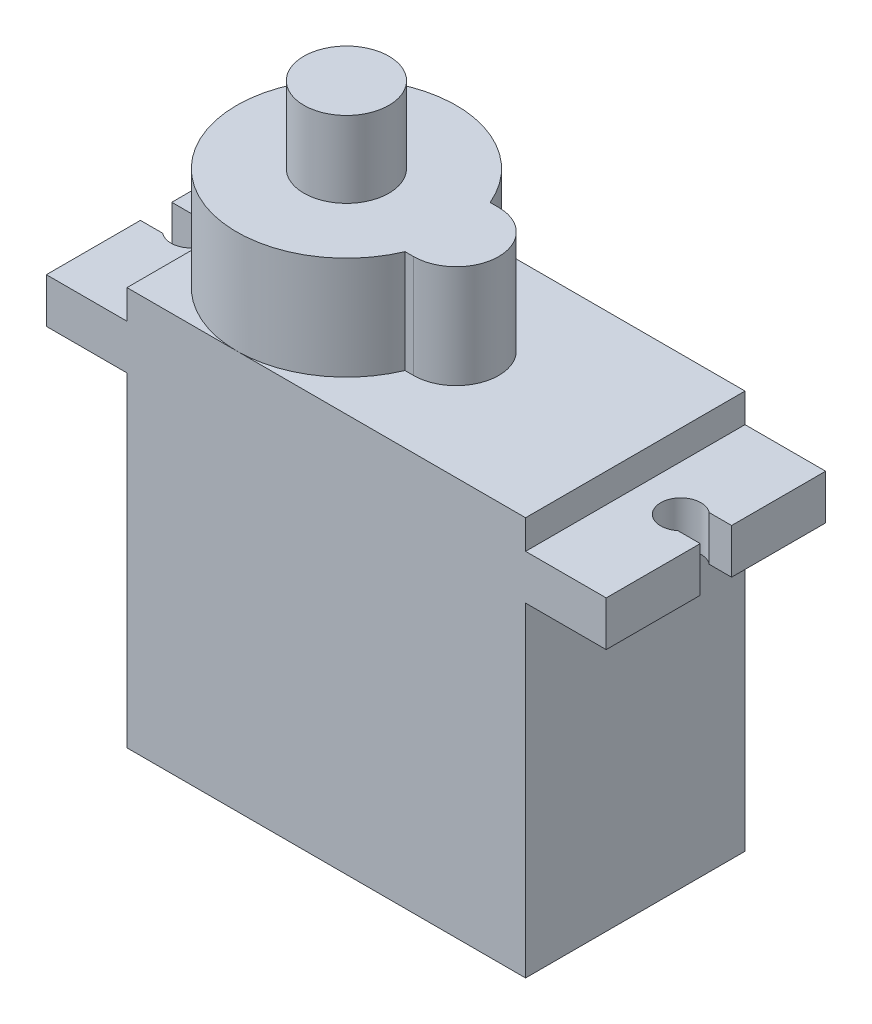
ISO-10303-21;
HEADER;
FILE_DESCRIPTION(('STEP AP214'),'2;1');
FILE_NAME('part.step','',(''),(''),'','','');
FILE_SCHEMA(('AUTOMOTIVE_DESIGN { 1 0 10303 214 1 1 1 1 }'));
ENDSEC;
DATA;
#1=APPLICATION_CONTEXT('core data for automotive mechanical design processes');
#2=APPLICATION_PROTOCOL_DEFINITION('international standard','automotive_design',2000,#1);
#3=PRODUCT_CONTEXT('',#1,'mechanical');
#4=PRODUCT('Part','Part','',(#3));
#5=PRODUCT_RELATED_PRODUCT_CATEGORY('part','',(#4));
#6=PRODUCT_DEFINITION_FORMATION('','',#4);
#7=PRODUCT_DEFINITION_CONTEXT('part definition',#1,'design');
#8=PRODUCT_DEFINITION('design','',#6,#7);
#9=PRODUCT_DEFINITION_SHAPE('','',#8);
#10=(LENGTH_UNIT() NAMED_UNIT(*) SI_UNIT(.MILLI.,.METRE.));
#11=(NAMED_UNIT(*) PLANE_ANGLE_UNIT() SI_UNIT($,.RADIAN.));
#12=(NAMED_UNIT(*) SI_UNIT($,.STERADIAN.) SOLID_ANGLE_UNIT());
#13=UNCERTAINTY_MEASURE_WITH_UNIT(LENGTH_MEASURE(1.E-05),#10,'distance_accuracy_value','');
#14=(GEOMETRIC_REPRESENTATION_CONTEXT(3) GLOBAL_UNCERTAINTY_ASSIGNED_CONTEXT((#13)) GLOBAL_UNIT_ASSIGNED_CONTEXT((#10,
#11,#12)) REPRESENTATION_CONTEXT('',''));
#15=CARTESIAN_POINT('',(0.,0.,0.));
#16=DIRECTION('',(0.,0.,1.));
#17=DIRECTION('',(1.,0.,0.));
#18=AXIS2_PLACEMENT_3D('',#15,#16,#17);
#19=CARTESIAN_POINT('',(0.,22.606,0.));
#20=DIRECTION('',(0.,1.,0.));
#21=DIRECTION('',(0.,0.,1.));
#22=AXIS2_PLACEMENT_3D('',#19,#20,#21);
#23=PLANE('',#22);
#24=DIRECTION('',(-1.,0.,0.));
#25=VECTOR('',#24,1.);
#26=CARTESIAN_POINT('',(0.,22.606,2.413));
#27=LINE('',#26,#25);
#28=CARTESIAN_POINT('',(1.143,22.606,2.413));
#29=VERTEX_POINT('',#28);
#30=CARTESIAN_POINT('',(0.656127613643196,22.606,2.413));
#31=VERTEX_POINT('',#30);
#32=EDGE_CURVE('E232',#29,#31,#27,.T.);
#33=ORIENTED_EDGE('',*,*,#32,.T.);
#34=CARTESIAN_POINT('',(-5.08,22.606,0.));
#35=DIRECTION('',(0.,1.,0.));
#36=DIRECTION('',(0.,0.,1.));
#37=AXIS2_PLACEMENT_3D('',#34,#35,#36);
#38=CIRCLE('',#37,6.223);
#39=CARTESIAN_POINT('',(-5.08,22.606,6.223));
#40=VERTEX_POINT('',#39);
#41=EDGE_CURVE('E51',#31,#40,#38,.F.);
#42=ORIENTED_EDGE('',*,*,#41,.T.);
#43=DIRECTION('',(1.,0.,0.));
#44=VECTOR('',#43,1.);
#45=CARTESIAN_POINT('',(11.303,22.606,6.223));
#46=LINE('',#45,#44);
#47=CARTESIAN_POINT('',(11.303,22.606,6.223));
#48=VERTEX_POINT('',#47);
#49=EDGE_CURVE('E248',#40,#48,#46,.T.);
#50=ORIENTED_EDGE('',*,*,#49,.T.);
#51=DIRECTION('',(0.,0.,-1.));
#52=VECTOR('',#51,1.);
#53=CARTESIAN_POINT('',(11.303,22.606,6.223));
#54=LINE('',#53,#52);
#55=CARTESIAN_POINT('',(11.303,22.606,-6.223));
#56=VERTEX_POINT('',#55);
#57=EDGE_CURVE('E253',#48,#56,#54,.T.);
#58=ORIENTED_EDGE('',*,*,#57,.T.);
#59=DIRECTION('',(-1.,0.,0.));
#60=VECTOR('',#59,1.);
#61=CARTESIAN_POINT('',(11.303,22.606,-6.223));
#62=LINE('',#61,#60);
#63=CARTESIAN_POINT('',(-5.08,22.606,-6.223));
#64=VERTEX_POINT('',#63);
#65=EDGE_CURVE('E256',#56,#64,#62,.T.);
#66=ORIENTED_EDGE('',*,*,#65,.T.);
#67=CARTESIAN_POINT('',(0.656127613643197,22.606,-2.413));
#68=VERTEX_POINT('',#67);
#69=EDGE_CURVE('E234',#64,#68,#38,.F.);
#70=ORIENTED_EDGE('',*,*,#69,.T.);
#71=DIRECTION('',(-1.,0.,0.));
#72=VECTOR('',#71,1.);
#73=CARTESIAN_POINT('',(0.,22.606,-2.413));
#74=LINE('',#73,#72);
#75=CARTESIAN_POINT('',(1.143,22.606,-2.413));
#76=VERTEX_POINT('',#75);
#77=EDGE_CURVE('E221',#76,#68,#74,.T.);
#78=ORIENTED_EDGE('',*,*,#77,.F.);
#79=CARTESIAN_POINT('',(1.143,22.606,0.));
#80=DIRECTION('',(0.,1.,0.));
#81=DIRECTION('',(0.,0.,1.));
#82=AXIS2_PLACEMENT_3D('',#79,#80,#81);
#83=CIRCLE('',#82,2.413);
#84=EDGE_CURVE('E236',#29,#76,#83,.T.);
#85=ORIENTED_EDGE('',*,*,#84,.F.);
#86=EDGE_LOOP('',(#33,#42,#50,#58,#66,#70,#78,#85));
#87=FACE_BOUND('',#86,.T.);
#88=ADVANCED_FACE('F34',(#87),#23,.T.);
#89=CARTESIAN_POINT('',(-11.303,22.606,6.223));
#90=VERTEX_POINT('',#89);
#91=EDGE_CURVE('E250',#90,#40,#46,.T.);
#92=ORIENTED_EDGE('',*,*,#91,.T.);
#93=CARTESIAN_POINT('',(-11.303,22.606,0.));
#94=VERTEX_POINT('',#93);
#95=EDGE_CURVE('E43',#40,#94,#38,.F.);
#96=ORIENTED_EDGE('',*,*,#95,.T.);
#97=DIRECTION('',(0.,0.,1.));
#98=VECTOR('',#97,1.);
#99=CARTESIAN_POINT('',(-11.303,22.606,6.223));
#100=LINE('',#99,#98);
#101=EDGE_CURVE('E249',#94,#90,#100,.T.);
#102=ORIENTED_EDGE('',*,*,#101,.T.);
#103=EDGE_LOOP('',(#92,#96,#102));
#104=FACE_BOUND('',#103,.T.);
#105=ADVANCED_FACE('F404',(#104),#23,.T.);
#106=CARTESIAN_POINT('',(-11.303,22.606,-6.223));
#107=VERTEX_POINT('',#106);
#108=EDGE_CURVE('E245',#107,#94,#100,.T.);
#109=ORIENTED_EDGE('',*,*,#108,.T.);
#110=EDGE_CURVE('E395',#94,#64,#38,.F.);
#111=ORIENTED_EDGE('',*,*,#110,.T.);
#112=EDGE_CURVE('E255',#64,#107,#62,.T.);
#113=ORIENTED_EDGE('',*,*,#112,.T.);
#114=EDGE_LOOP('',(#109,#111,#113));
#115=FACE_BOUND('',#114,.T.);
#116=ADVANCED_FACE('F410',(#115),#23,.T.);
#117=CARTESIAN_POINT('',(-13.8865795103145,20.955,0.));
#118=DIRECTION('',(0.,-1.,0.));
#119=DIRECTION('',(0.,0.,-1.));
#120=AXIS2_PLACEMENT_3D('',#117,#118,#119);
#121=PLANE('',#120);
#122=DIRECTION('',(0.,0.,1.));
#123=VECTOR('',#122,1.);
#124=CARTESIAN_POINT('',(-11.303,20.955,6.223));
#125=LINE('',#124,#123);
#126=CARTESIAN_POINT('',(-11.303,20.955,-6.223));
#127=VERTEX_POINT('',#126);
#128=CARTESIAN_POINT('',(-11.303,20.955,6.223));
#129=VERTEX_POINT('',#128);
#130=EDGE_CURVE('E59',#127,#129,#125,.T.);
#131=ORIENTED_EDGE('',*,*,#130,.F.);
#132=DIRECTION('',(-1.,0.,0.));
#133=VECTOR('',#132,1.);
#134=CARTESIAN_POINT('',(15.875,20.955,-6.223));
#135=LINE('',#134,#133);
#136=CARTESIAN_POINT('',(-15.875,20.955,-6.223));
#137=VERTEX_POINT('',#136);
#138=EDGE_CURVE('E301',#127,#137,#135,.T.);
#139=ORIENTED_EDGE('',*,*,#138,.T.);
#140=DIRECTION('',(0.,0.,1.));
#141=VECTOR('',#140,1.);
#142=CARTESIAN_POINT('',(-15.875,20.955,-6.223));
#143=LINE('',#142,#141);
#144=CARTESIAN_POINT('',(-15.875,20.955,-0.889));
#145=VERTEX_POINT('',#144);
#146=EDGE_CURVE('E276',#137,#145,#143,.T.);
#147=ORIENTED_EDGE('',*,*,#146,.T.);
#148=DIRECTION('',(1.,0.,0.));
#149=VECTOR('',#148,1.);
#150=CARTESIAN_POINT('',(-15.875,20.955,-0.889));
#151=LINE('',#150,#149);
#152=CARTESIAN_POINT('',(-14.605,20.955,-0.889));
#153=VERTEX_POINT('',#152);
#154=EDGE_CURVE('E279',#145,#153,#151,.T.);
#155=ORIENTED_EDGE('',*,*,#154,.T.);
#156=CARTESIAN_POINT('',(-13.8865795103145,20.955,0.));
#157=DIRECTION('',(0.,-1.,0.));
#158=DIRECTION('',(0.,0.,-1.));
#159=AXIS2_PLACEMENT_3D('',#156,#157,#158);
#160=CIRCLE('',#159,1.143);
#161=CARTESIAN_POINT('',(-14.605,20.955,0.889));
#162=VERTEX_POINT('',#161);
#163=EDGE_CURVE('E282',#153,#162,#160,.T.);
#164=ORIENTED_EDGE('',*,*,#163,.T.);
#165=DIRECTION('',(-1.,0.,0.));
#166=VECTOR('',#165,1.);
#167=CARTESIAN_POINT('',(-15.875,20.955,0.889));
#168=LINE('',#167,#166);
#169=CARTESIAN_POINT('',(-15.875,20.955,0.889));
#170=VERTEX_POINT('',#169);
#171=EDGE_CURVE('E284',#162,#170,#168,.T.);
#172=ORIENTED_EDGE('',*,*,#171,.T.);
#173=DIRECTION('',(0.,0.,1.));
#174=VECTOR('',#173,1.);
#175=CARTESIAN_POINT('',(-15.875,20.955,6.223));
#176=LINE('',#175,#174);
#177=CARTESIAN_POINT('',(-15.875,20.955,6.223));
#178=VERTEX_POINT('',#177);
#179=EDGE_CURVE('E286',#170,#178,#176,.T.);
#180=ORIENTED_EDGE('',*,*,#179,.T.);
#181=DIRECTION('',(1.,0.,0.));
#182=VECTOR('',#181,1.);
#183=CARTESIAN_POINT('',(15.875,20.955,6.223));
#184=LINE('',#183,#182);
#185=EDGE_CURVE('E289',#178,#129,#184,.T.);
#186=ORIENTED_EDGE('',*,*,#185,.T.);
#187=EDGE_LOOP('',(#131,#139,#147,#155,#164,#172,#180,#186));
#188=FACE_BOUND('',#187,.T.);
#189=ADVANCED_FACE('F417',(#188),#121,.F.);
#190=DIRECTION('',(0.,0.,-1.));
#191=VECTOR('',#190,1.);
#192=CARTESIAN_POINT('',(11.303,20.955,6.223));
#193=LINE('',#192,#191);
#194=CARTESIAN_POINT('',(11.303,20.955,6.223));
#195=VERTEX_POINT('',#194);
#196=CARTESIAN_POINT('',(11.303,20.955,-6.223));
#197=VERTEX_POINT('',#196);
#198=EDGE_CURVE('E261',#195,#197,#193,.T.);
#199=ORIENTED_EDGE('',*,*,#198,.F.);
#200=CARTESIAN_POINT('',(15.875,20.955,6.223));
#201=VERTEX_POINT('',#200);
#202=EDGE_CURVE('E288',#195,#201,#184,.T.);
#203=ORIENTED_EDGE('',*,*,#202,.T.);
#204=DIRECTION('',(0.,0.,-1.));
#205=VECTOR('',#204,1.);
#206=CARTESIAN_POINT('',(15.875,20.955,6.223));
#207=LINE('',#206,#205);
#208=CARTESIAN_POINT('',(15.875,20.955,0.889000000000035));
#209=VERTEX_POINT('',#208);
#210=EDGE_CURVE('E291',#201,#209,#207,.T.);
#211=ORIENTED_EDGE('',*,*,#210,.T.);
#212=DIRECTION('',(-1.,0.,0.));
#213=VECTOR('',#212,1.);
#214=CARTESIAN_POINT('',(15.875,20.955,0.889000000000035));
#215=LINE('',#214,#213);
#216=CARTESIAN_POINT('',(14.605,20.955,0.889000000000034));
#217=VERTEX_POINT('',#216);
#218=EDGE_CURVE('E293',#209,#217,#215,.T.);
#219=ORIENTED_EDGE('',*,*,#218,.T.);
#220=CARTESIAN_POINT('',(13.8865795103145,20.955,0.));
#221=DIRECTION('',(0.,-1.,0.));
#222=DIRECTION('',(0.,0.,1.));
#223=AXIS2_PLACEMENT_3D('',#220,#221,#222);
#224=CIRCLE('',#223,1.143);
#225=CARTESIAN_POINT('',(14.605,20.955,-0.888999999999967));
#226=VERTEX_POINT('',#225);
#227=EDGE_CURVE('E295',#217,#226,#224,.T.);
#228=ORIENTED_EDGE('',*,*,#227,.T.);
#229=DIRECTION('',(1.,0.,0.));
#230=VECTOR('',#229,1.);
#231=CARTESIAN_POINT('',(15.875,20.955,-0.888999999999965));
#232=LINE('',#231,#230);
#233=CARTESIAN_POINT('',(15.875,20.955,-0.888999999999965));
#234=VERTEX_POINT('',#233);
#235=EDGE_CURVE('E297',#226,#234,#232,.T.);
#236=ORIENTED_EDGE('',*,*,#235,.T.);
#237=DIRECTION('',(0.,0.,-1.));
#238=VECTOR('',#237,1.);
#239=CARTESIAN_POINT('',(15.875,20.955,-6.223));
#240=LINE('',#239,#238);
#241=CARTESIAN_POINT('',(15.875,20.955,-6.223));
#242=VERTEX_POINT('',#241);
#243=EDGE_CURVE('E299',#234,#242,#240,.T.);
#244=ORIENTED_EDGE('',*,*,#243,.T.);
#245=EDGE_CURVE('E302',#242,#197,#135,.T.);
#246=ORIENTED_EDGE('',*,*,#245,.T.);
#247=EDGE_LOOP('',(#199,#203,#211,#219,#228,#236,#244,#246));
#248=FACE_BOUND('',#247,.T.);
#249=ADVANCED_FACE('F475',(#248),#121,.F.);
#250=CARTESIAN_POINT('',(-11.303,18.415,6.223));
#251=DIRECTION('',(1.,0.,0.));
#252=DIRECTION('',(0.,0.,-1.));
#253=AXIS2_PLACEMENT_3D('',#250,#251,#252);
#254=PLANE('',#253);
#255=DIRECTION('',(0.,0.,1.));
#256=VECTOR('',#255,1.);
#257=CARTESIAN_POINT('',(-11.303,0.,6.223));
#258=LINE('',#257,#256);
#259=CARTESIAN_POINT('',(-11.303,0.,-6.223));
#260=VERTEX_POINT('',#259);
#261=CARTESIAN_POINT('',(-11.303,0.,6.223));
#262=VERTEX_POINT('',#261);
#263=EDGE_CURVE('E367',#260,#262,#258,.T.);
#264=ORIENTED_EDGE('',*,*,#263,.T.);
#265=DIRECTION('',(0.,-1.,0.));
#266=VECTOR('',#265,1.);
#267=CARTESIAN_POINT('',(-11.303,18.415,6.223));
#268=LINE('',#267,#266);
#269=CARTESIAN_POINT('',(-11.303,18.415,6.223));
#270=VERTEX_POINT('',#269);
#271=EDGE_CURVE('E38',#270,#262,#268,.T.);
#272=ORIENTED_EDGE('',*,*,#271,.F.);
#273=DIRECTION('',(0.,0.,1.));
#274=VECTOR('',#273,1.);
#275=CARTESIAN_POINT('',(-11.303,18.415,6.223));
#276=LINE('',#275,#274);
#277=CARTESIAN_POINT('',(-11.303,18.415,-6.223));
#278=VERTEX_POINT('',#277);
#279=EDGE_CURVE('E368',#278,#270,#276,.T.);
#280=ORIENTED_EDGE('',*,*,#279,.F.);
#281=DIRECTION('',(0.,-1.,0.));
#282=VECTOR('',#281,1.);
#283=CARTESIAN_POINT('',(-11.303,18.415,-6.223));
#284=LINE('',#283,#282);
#285=EDGE_CURVE('E375',#278,#260,#284,.T.);
#286=ORIENTED_EDGE('',*,*,#285,.T.);
#287=EDGE_LOOP('',(#264,#272,#280,#286));
#288=FACE_BOUND('',#287,.T.);
#289=ADVANCED_FACE('F36',(#288),#254,.F.);
#290=CARTESIAN_POINT('',(11.303,18.415,6.223));
#291=DIRECTION('',(0.,0.,-1.));
#292=DIRECTION('',(-1.,0.,0.));
#293=AXIS2_PLACEMENT_3D('',#290,#291,#292);
#294=PLANE('',#293);
#295=DIRECTION('',(1.,0.,0.));
#296=VECTOR('',#295,1.);
#297=CARTESIAN_POINT('',(11.303,0.,6.223));
#298=LINE('',#297,#296);
#299=CARTESIAN_POINT('',(11.303,0.,6.223));
#300=VERTEX_POINT('',#299);
#301=EDGE_CURVE('E378',#262,#300,#298,.T.);
#302=ORIENTED_EDGE('',*,*,#301,.T.);
#303=DIRECTION('',(0.,-1.,0.));
#304=VECTOR('',#303,1.);
#305=CARTESIAN_POINT('',(11.303,18.415,6.223));
#306=LINE('',#305,#304);
#307=CARTESIAN_POINT('',(11.303,18.415,6.223));
#308=VERTEX_POINT('',#307);
#309=EDGE_CURVE('E387',#308,#300,#306,.T.);
#310=ORIENTED_EDGE('',*,*,#309,.F.);
#311=DIRECTION('',(1.,0.,0.));
#312=VECTOR('',#311,1.);
#313=CARTESIAN_POINT('',(15.875,18.415,6.223));
#314=LINE('',#313,#312);
#315=CARTESIAN_POINT('',(15.875,18.415,6.223));
#316=VERTEX_POINT('',#315);
#317=EDGE_CURVE('E315',#308,#316,#314,.T.);
#318=ORIENTED_EDGE('',*,*,#317,.T.);
#319=DIRECTION('',(0.,-1.,0.));
#320=VECTOR('',#319,1.);
#321=CARTESIAN_POINT('',(15.875,20.955,6.223));
#322=LINE('',#321,#320);
#323=EDGE_CURVE('E349',#201,#316,#322,.T.);
#324=ORIENTED_EDGE('',*,*,#323,.F.);
#325=ORIENTED_EDGE('',*,*,#202,.F.);
#326=DIRECTION('',(0.,-1.,0.));
#327=VECTOR('',#326,1.);
#328=CARTESIAN_POINT('',(11.303,22.606,6.223));
#329=LINE('',#328,#327);
#330=EDGE_CURVE('E269',#48,#195,#329,.T.);
#331=ORIENTED_EDGE('',*,*,#330,.F.);
#332=ORIENTED_EDGE('',*,*,#49,.F.);
#333=ORIENTED_EDGE('',*,*,#91,.F.);
#334=DIRECTION('',(0.,-1.,0.));
#335=VECTOR('',#334,1.);
#336=CARTESIAN_POINT('',(-11.303,22.606,6.223));
#337=LINE('',#336,#335);
#338=EDGE_CURVE('E272',#90,#129,#337,.T.);
#339=ORIENTED_EDGE('',*,*,#338,.T.);
#340=ORIENTED_EDGE('',*,*,#185,.F.);
#341=DIRECTION('',(0.,-1.,0.));
#342=VECTOR('',#341,1.);
#343=CARTESIAN_POINT('',(-15.875,20.955,6.223));
#344=LINE('',#343,#342);
#345=CARTESIAN_POINT('',(-15.875,18.415,6.223));
#346=VERTEX_POINT('',#345);
#347=EDGE_CURVE('E352',#178,#346,#344,.T.);
#348=ORIENTED_EDGE('',*,*,#347,.T.);
#349=EDGE_CURVE('E316',#346,#270,#314,.T.);
#350=ORIENTED_EDGE('',*,*,#349,.T.);
#351=ORIENTED_EDGE('',*,*,#271,.T.);
#352=EDGE_LOOP('',(#302,#310,#318,#324,#325,#331,#332,#333,#339,#340,#348,#350,#351));
#353=FACE_BOUND('',#352,.T.);
#354=ADVANCED_FACE('F442',(#353),#294,.F.);
#355=CARTESIAN_POINT('',(11.303,18.415,6.223));
#356=DIRECTION('',(-1.,0.,0.));
#357=DIRECTION('',(0.,0.,1.));
#358=AXIS2_PLACEMENT_3D('',#355,#356,#357);
#359=PLANE('',#358);
#360=DIRECTION('',(0.,0.,-1.));
#361=VECTOR('',#360,1.);
#362=CARTESIAN_POINT('',(11.303,0.,6.223));
#363=LINE('',#362,#361);
#364=CARTESIAN_POINT('',(11.303,0.,-6.223));
#365=VERTEX_POINT('',#364);
#366=EDGE_CURVE('E380',#300,#365,#363,.T.);
#367=ORIENTED_EDGE('',*,*,#366,.T.);
#368=DIRECTION('',(0.,-1.,0.));
#369=VECTOR('',#368,1.);
#370=CARTESIAN_POINT('',(11.303,18.415,-6.223));
#371=LINE('',#370,#369);
#372=CARTESIAN_POINT('',(11.303,18.415,-6.223));
#373=VERTEX_POINT('',#372);
#374=EDGE_CURVE('E385',#373,#365,#371,.T.);
#375=ORIENTED_EDGE('',*,*,#374,.F.);
#376=DIRECTION('',(0.,0.,-1.));
#377=VECTOR('',#376,1.);
#378=CARTESIAN_POINT('',(11.303,18.415,6.223));
#379=LINE('',#378,#377);
#380=EDGE_CURVE('E371',#308,#373,#379,.T.);
#381=ORIENTED_EDGE('',*,*,#380,.F.);
#382=ORIENTED_EDGE('',*,*,#309,.T.);
#383=EDGE_LOOP('',(#367,#375,#381,#382));
#384=FACE_BOUND('',#383,.T.);
#385=ADVANCED_FACE('F524',(#384),#359,.F.);
#386=CARTESIAN_POINT('',(11.303,18.415,-6.223));
#387=DIRECTION('',(0.,0.,1.));
#388=DIRECTION('',(1.,0.,0.));
#389=AXIS2_PLACEMENT_3D('',#386,#387,#388);
#390=PLANE('',#389);
#391=DIRECTION('',(-1.,0.,0.));
#392=VECTOR('',#391,1.);
#393=CARTESIAN_POINT('',(11.303,0.,-6.223));
#394=LINE('',#393,#392);
#395=EDGE_CURVE('E372',#365,#260,#394,.T.);
#396=ORIENTED_EDGE('',*,*,#395,.T.);
#397=ORIENTED_EDGE('',*,*,#285,.F.);
#398=DIRECTION('',(-1.,0.,0.));
#399=VECTOR('',#398,1.);
#400=CARTESIAN_POINT('',(15.875,18.415,-6.223));
#401=LINE('',#400,#399);
#402=CARTESIAN_POINT('',(-15.875,18.415,-6.223));
#403=VERTEX_POINT('',#402);
#404=EDGE_CURVE('E329',#278,#403,#401,.T.);
#405=ORIENTED_EDGE('',*,*,#404,.T.);
#406=DIRECTION('',(0.,-1.,0.));
#407=VECTOR('',#406,1.);
#408=CARTESIAN_POINT('',(-15.875,20.955,-6.223));
#409=LINE('',#408,#407);
#410=EDGE_CURVE('E304',#137,#403,#409,.T.);
#411=ORIENTED_EDGE('',*,*,#410,.F.);
#412=ORIENTED_EDGE('',*,*,#138,.F.);
#413=DIRECTION('',(0.,-1.,0.));
#414=VECTOR('',#413,1.);
#415=CARTESIAN_POINT('',(-11.303,22.606,-6.223));
#416=LINE('',#415,#414);
#417=EDGE_CURVE('E259',#107,#127,#416,.T.);
#418=ORIENTED_EDGE('',*,*,#417,.F.);
#419=ORIENTED_EDGE('',*,*,#112,.F.);
#420=ORIENTED_EDGE('',*,*,#65,.F.);
#421=DIRECTION('',(0.,-1.,0.));
#422=VECTOR('',#421,1.);
#423=CARTESIAN_POINT('',(11.303,22.606,-6.223));
#424=LINE('',#423,#422);
#425=EDGE_CURVE('E266',#56,#197,#424,.T.);
#426=ORIENTED_EDGE('',*,*,#425,.T.);
#427=ORIENTED_EDGE('',*,*,#245,.F.);
#428=DIRECTION('',(0.,-1.,0.));
#429=VECTOR('',#428,1.);
#430=CARTESIAN_POINT('',(15.875,20.955,-6.223));
#431=LINE('',#430,#429);
#432=CARTESIAN_POINT('',(15.875,18.415,-6.223));
#433=VERTEX_POINT('',#432);
#434=EDGE_CURVE('E334',#242,#433,#431,.T.);
#435=ORIENTED_EDGE('',*,*,#434,.T.);
#436=EDGE_CURVE('E280',#433,#373,#401,.T.);
#437=ORIENTED_EDGE('',*,*,#436,.T.);
#438=ORIENTED_EDGE('',*,*,#374,.T.);
#439=EDGE_LOOP('',(#396,#397,#405,#411,#412,#418,#419,#420,#426,#427,#435,#437,#438));
#440=FACE_BOUND('',#439,.T.);
#441=ADVANCED_FACE('F414',(#440),#390,.F.);
#442=CARTESIAN_POINT('',(0.,0.,0.));
#443=DIRECTION('',(0.,1.,0.));
#444=DIRECTION('',(0.,0.,1.));
#445=AXIS2_PLACEMENT_3D('',#442,#443,#444);
#446=PLANE('',#445);
#447=ORIENTED_EDGE('',*,*,#263,.F.);
#448=ORIENTED_EDGE('',*,*,#395,.F.);
#449=ORIENTED_EDGE('',*,*,#366,.F.);
#450=ORIENTED_EDGE('',*,*,#301,.F.);
#451=EDGE_LOOP('',(#447,#448,#449,#450));
#452=FACE_BOUND('',#451,.T.);
#453=ADVANCED_FACE('F518',(#452),#446,.F.);
#454=CARTESIAN_POINT('',(-13.8865795103145,18.415,0.));
#455=DIRECTION('',(0.,-1.,0.));
#456=DIRECTION('',(0.,0.,-1.));
#457=AXIS2_PLACEMENT_3D('',#454,#455,#456);
#458=PLANE('',#457);
#459=ORIENTED_EDGE('',*,*,#404,.F.);
#460=ORIENTED_EDGE('',*,*,#279,.T.);
#461=ORIENTED_EDGE('',*,*,#349,.F.);
#462=DIRECTION('',(0.,0.,1.));
#463=VECTOR('',#462,1.);
#464=CARTESIAN_POINT('',(-15.875,18.415,6.223));
#465=LINE('',#464,#463);
#466=CARTESIAN_POINT('',(-15.875,18.415,0.889));
#467=VERTEX_POINT('',#466);
#468=EDGE_CURVE('E313',#467,#346,#465,.T.);
#469=ORIENTED_EDGE('',*,*,#468,.F.);
#470=DIRECTION('',(-1.,0.,0.));
#471=VECTOR('',#470,1.);
#472=CARTESIAN_POINT('',(-15.875,18.415,0.889));
#473=LINE('',#472,#471);
#474=CARTESIAN_POINT('',(-14.605,18.415,0.889));
#475=VERTEX_POINT('',#474);
#476=EDGE_CURVE('E311',#475,#467,#473,.T.);
#477=ORIENTED_EDGE('',*,*,#476,.F.);
#478=CARTESIAN_POINT('',(-13.8865795103145,18.415,0.));
#479=DIRECTION('',(0.,-1.,0.));
#480=DIRECTION('',(0.,0.,-1.));
#481=AXIS2_PLACEMENT_3D('',#478,#479,#480);
#482=CIRCLE('',#481,1.143);
#483=CARTESIAN_POINT('',(-14.605,18.415,-0.889));
#484=VERTEX_POINT('',#483);
#485=EDGE_CURVE('E309',#484,#475,#482,.T.);
#486=ORIENTED_EDGE('',*,*,#485,.F.);
#487=DIRECTION('',(1.,0.,0.));
#488=VECTOR('',#487,1.);
#489=CARTESIAN_POINT('',(-15.875,18.415,-0.889));
#490=LINE('',#489,#488);
#491=CARTESIAN_POINT('',(-15.875,18.415,-0.889));
#492=VERTEX_POINT('',#491);
#493=EDGE_CURVE('E307',#492,#484,#490,.T.);
#494=ORIENTED_EDGE('',*,*,#493,.F.);
#495=DIRECTION('',(0.,0.,1.));
#496=VECTOR('',#495,1.);
#497=CARTESIAN_POINT('',(-15.875,18.415,-6.223));
#498=LINE('',#497,#496);
#499=EDGE_CURVE('E275',#403,#492,#498,.T.);
#500=ORIENTED_EDGE('',*,*,#499,.F.);
#501=EDGE_LOOP('',(#459,#460,#461,#469,#477,#486,#494,#500));
#502=FACE_BOUND('',#501,.T.);
#503=ADVANCED_FACE('F488',(#502),#458,.T.);
#504=CARTESIAN_POINT('',(-15.875,20.955,-6.223));
#505=DIRECTION('',(1.,0.,0.));
#506=DIRECTION('',(0.,0.,-1.));
#507=AXIS2_PLACEMENT_3D('',#504,#505,#506);
#508=PLANE('',#507);
#509=ORIENTED_EDGE('',*,*,#499,.T.);
#510=DIRECTION('',(0.,-1.,0.));
#511=VECTOR('',#510,1.);
#512=CARTESIAN_POINT('',(-15.875,20.955,-0.889));
#513=LINE('',#512,#511);
#514=EDGE_CURVE('E364',#145,#492,#513,.T.);
#515=ORIENTED_EDGE('',*,*,#514,.F.);
#516=ORIENTED_EDGE('',*,*,#146,.F.);
#517=ORIENTED_EDGE('',*,*,#410,.T.);
#518=EDGE_LOOP('',(#509,#515,#516,#517));
#519=FACE_BOUND('',#518,.T.);
#520=ADVANCED_FACE('F421',(#519),#508,.F.);
#521=CARTESIAN_POINT('',(-15.875,20.955,-0.889));
#522=DIRECTION('',(0.,0.,-1.));
#523=DIRECTION('',(-1.,0.,0.));
#524=AXIS2_PLACEMENT_3D('',#521,#522,#523);
#525=PLANE('',#524);
#526=ORIENTED_EDGE('',*,*,#493,.T.);
#527=DIRECTION('',(0.,-1.,0.));
#528=VECTOR('',#527,1.);
#529=CARTESIAN_POINT('',(-14.605,20.955,-0.889));
#530=LINE('',#529,#528);
#531=EDGE_CURVE('E361',#153,#484,#530,.T.);
#532=ORIENTED_EDGE('',*,*,#531,.F.);
#533=ORIENTED_EDGE('',*,*,#154,.F.);
#534=ORIENTED_EDGE('',*,*,#514,.T.);
#535=EDGE_LOOP('',(#526,#532,#533,#534));
#536=FACE_BOUND('',#535,.T.);
#537=ADVANCED_FACE('F424',(#536),#525,.F.);
#538=CARTESIAN_POINT('',(-13.8865795103145,20.955,0.));
#539=DIRECTION('',(0.,-1.,0.));
#540=DIRECTION('',(0.,0.,-1.));
#541=AXIS2_PLACEMENT_3D('',#538,#539,#540);
#542=CYLINDRICAL_SURFACE('',#541,1.143);
#543=ORIENTED_EDGE('',*,*,#485,.T.);
#544=DIRECTION('',(0.,-1.,0.));
#545=VECTOR('',#544,1.);
#546=CARTESIAN_POINT('',(-14.605,20.955,0.889));
#547=LINE('',#546,#545);
#548=EDGE_CURVE('E358',#162,#475,#547,.T.);
#549=ORIENTED_EDGE('',*,*,#548,.F.);
#550=ORIENTED_EDGE('',*,*,#163,.F.);
#551=ORIENTED_EDGE('',*,*,#531,.T.);
#552=EDGE_LOOP('',(#543,#549,#550,#551));
#553=FACE_BOUND('',#552,.T.);
#554=ADVANCED_FACE('F429',(#553),#542,.F.);
#555=CARTESIAN_POINT('',(-15.875,20.955,0.889));
#556=DIRECTION('',(0.,0.,1.));
#557=DIRECTION('',(1.,0.,0.));
#558=AXIS2_PLACEMENT_3D('',#555,#556,#557);
#559=PLANE('',#558);
#560=ORIENTED_EDGE('',*,*,#476,.T.);
#561=DIRECTION('',(0.,-1.,0.));
#562=VECTOR('',#561,1.);
#563=CARTESIAN_POINT('',(-15.875,20.955,0.889));
#564=LINE('',#563,#562);
#565=EDGE_CURVE('E355',#170,#467,#564,.T.);
#566=ORIENTED_EDGE('',*,*,#565,.F.);
#567=ORIENTED_EDGE('',*,*,#171,.F.);
#568=ORIENTED_EDGE('',*,*,#548,.T.);
#569=EDGE_LOOP('',(#560,#566,#567,#568));
#570=FACE_BOUND('',#569,.T.);
#571=ADVANCED_FACE('F435',(#570),#559,.F.);
#572=CARTESIAN_POINT('',(-15.875,20.955,6.223));
#573=DIRECTION('',(1.,0.,0.));
#574=DIRECTION('',(0.,0.,-1.));
#575=AXIS2_PLACEMENT_3D('',#572,#573,#574);
#576=PLANE('',#575);
#577=ORIENTED_EDGE('',*,*,#468,.T.);
#578=ORIENTED_EDGE('',*,*,#347,.F.);
#579=ORIENTED_EDGE('',*,*,#179,.F.);
#580=ORIENTED_EDGE('',*,*,#565,.T.);
#581=EDGE_LOOP('',(#577,#578,#579,#580));
#582=FACE_BOUND('',#581,.T.);
#583=ADVANCED_FACE('F439',(#582),#576,.F.);
#584=CARTESIAN_POINT('',(15.875,20.955,6.223));
#585=DIRECTION('',(-1.,0.,0.));
#586=DIRECTION('',(0.,0.,1.));
#587=AXIS2_PLACEMENT_3D('',#584,#585,#586);
#588=PLANE('',#587);
#589=DIRECTION('',(0.,0.,-1.));
#590=VECTOR('',#589,1.);
#591=CARTESIAN_POINT('',(15.875,18.415,6.223));
#592=LINE('',#591,#590);
#593=CARTESIAN_POINT('',(15.875,18.415,0.889000000000035));
#594=VERTEX_POINT('',#593);
#595=EDGE_CURVE('E319',#316,#594,#592,.T.);
#596=ORIENTED_EDGE('',*,*,#595,.T.);
#597=DIRECTION('',(0.,-1.,0.));
#598=VECTOR('',#597,1.);
#599=CARTESIAN_POINT('',(15.875,20.955,0.889000000000035));
#600=LINE('',#599,#598);
#601=EDGE_CURVE('E346',#209,#594,#600,.T.);
#602=ORIENTED_EDGE('',*,*,#601,.F.);
#603=ORIENTED_EDGE('',*,*,#210,.F.);
#604=ORIENTED_EDGE('',*,*,#323,.T.);
#605=EDGE_LOOP('',(#596,#602,#603,#604));
#606=FACE_BOUND('',#605,.T.);
#607=ADVANCED_FACE('F503',(#606),#588,.F.);
#608=CARTESIAN_POINT('',(15.875,20.955,0.889000000000035));
#609=DIRECTION('',(0.,0.,1.));
#610=DIRECTION('',(1.,0.,0.));
#611=AXIS2_PLACEMENT_3D('',#608,#609,#610);
#612=PLANE('',#611);
#613=DIRECTION('',(-1.,0.,0.));
#614=VECTOR('',#613,1.);
#615=CARTESIAN_POINT('',(15.875,18.415,0.889000000000035));
#616=LINE('',#615,#614);
#617=CARTESIAN_POINT('',(14.605,18.415,0.889000000000034));
#618=VERTEX_POINT('',#617);
#619=EDGE_CURVE('E321',#594,#618,#616,.T.);
#620=ORIENTED_EDGE('',*,*,#619,.T.);
#621=DIRECTION('',(0.,-1.,0.));
#622=VECTOR('',#621,1.);
#623=CARTESIAN_POINT('',(14.605,20.955,0.889000000000034));
#624=LINE('',#623,#622);
#625=EDGE_CURVE('E343',#217,#618,#624,.T.);
#626=ORIENTED_EDGE('',*,*,#625,.F.);
#627=ORIENTED_EDGE('',*,*,#218,.F.);
#628=ORIENTED_EDGE('',*,*,#601,.T.);
#629=EDGE_LOOP('',(#620,#626,#627,#628));
#630=FACE_BOUND('',#629,.T.);
#631=ADVANCED_FACE('F499',(#630),#612,.F.);
#632=CARTESIAN_POINT('',(13.8865795103145,20.955,0.));
#633=DIRECTION('',(0.,-1.,0.));
#634=DIRECTION('',(0.,0.,-1.));
#635=AXIS2_PLACEMENT_3D('',#632,#633,#634);
#636=CYLINDRICAL_SURFACE('',#635,1.143);
#637=CARTESIAN_POINT('',(13.8865795103145,18.415,0.));
#638=DIRECTION('',(0.,-1.,0.));
#639=DIRECTION('',(0.,0.,1.));
#640=AXIS2_PLACEMENT_3D('',#637,#638,#639);
#641=CIRCLE('',#640,1.143);
#642=CARTESIAN_POINT('',(14.605,18.415,-0.888999999999967));
#643=VERTEX_POINT('',#642);
#644=EDGE_CURVE('E323',#618,#643,#641,.T.);
#645=ORIENTED_EDGE('',*,*,#644,.T.);
#646=DIRECTION('',(0.,-1.,0.));
#647=VECTOR('',#646,1.);
#648=CARTESIAN_POINT('',(14.605,20.955,-0.888999999999967));
#649=LINE('',#648,#647);
#650=EDGE_CURVE('E340',#226,#643,#649,.T.);
#651=ORIENTED_EDGE('',*,*,#650,.F.);
#652=ORIENTED_EDGE('',*,*,#227,.F.);
#653=ORIENTED_EDGE('',*,*,#625,.T.);
#654=EDGE_LOOP('',(#645,#651,#652,#653));
#655=FACE_BOUND('',#654,.T.);
#656=ADVANCED_FACE('F495',(#655),#636,.F.);
#657=CARTESIAN_POINT('',(15.875,20.955,-0.888999999999965));
#658=DIRECTION('',(0.,0.,-1.));
#659=DIRECTION('',(-1.,0.,0.));
#660=AXIS2_PLACEMENT_3D('',#657,#658,#659);
#661=PLANE('',#660);
#662=DIRECTION('',(1.,0.,0.));
#663=VECTOR('',#662,1.);
#664=CARTESIAN_POINT('',(15.875,18.415,-0.888999999999965));
#665=LINE('',#664,#663);
#666=CARTESIAN_POINT('',(15.875,18.415,-0.888999999999965));
#667=VERTEX_POINT('',#666);
#668=EDGE_CURVE('E325',#643,#667,#665,.T.);
#669=ORIENTED_EDGE('',*,*,#668,.T.);
#670=DIRECTION('',(0.,-1.,0.));
#671=VECTOR('',#670,1.);
#672=CARTESIAN_POINT('',(15.875,20.955,-0.888999999999965));
#673=LINE('',#672,#671);
#674=EDGE_CURVE('E337',#234,#667,#673,.T.);
#675=ORIENTED_EDGE('',*,*,#674,.F.);
#676=ORIENTED_EDGE('',*,*,#235,.F.);
#677=ORIENTED_EDGE('',*,*,#650,.T.);
#678=EDGE_LOOP('',(#669,#675,#676,#677));
#679=FACE_BOUND('',#678,.T.);
#680=ADVANCED_FACE('F491',(#679),#661,.F.);
#681=CARTESIAN_POINT('',(15.875,20.955,-6.223));
#682=DIRECTION('',(-1.,0.,0.));
#683=DIRECTION('',(0.,0.,1.));
#684=AXIS2_PLACEMENT_3D('',#681,#682,#683);
#685=PLANE('',#684);
#686=DIRECTION('',(0.,0.,-1.));
#687=VECTOR('',#686,1.);
#688=CARTESIAN_POINT('',(15.875,18.415,-6.223));
#689=LINE('',#688,#687);
#690=EDGE_CURVE('E327',#667,#433,#689,.T.);
#691=ORIENTED_EDGE('',*,*,#690,.T.);
#692=ORIENTED_EDGE('',*,*,#434,.F.);
#693=ORIENTED_EDGE('',*,*,#243,.F.);
#694=ORIENTED_EDGE('',*,*,#674,.T.);
#695=EDGE_LOOP('',(#691,#692,#693,#694));
#696=FACE_BOUND('',#695,.T.);
#697=ADVANCED_FACE('F486',(#696),#685,.F.);
#698=ORIENTED_EDGE('',*,*,#317,.F.);
#699=ORIENTED_EDGE('',*,*,#380,.T.);
#700=ORIENTED_EDGE('',*,*,#436,.F.);
#701=ORIENTED_EDGE('',*,*,#690,.F.);
#702=ORIENTED_EDGE('',*,*,#668,.F.);
#703=ORIENTED_EDGE('',*,*,#644,.F.);
#704=ORIENTED_EDGE('',*,*,#619,.F.);
#705=ORIENTED_EDGE('',*,*,#595,.F.);
#706=EDGE_LOOP('',(#698,#699,#700,#701,#702,#703,#704,#705));
#707=FACE_BOUND('',#706,.T.);
#708=ADVANCED_FACE('F483',(#707),#458,.T.);
#709=CARTESIAN_POINT('',(-11.303,22.606,6.223));
#710=DIRECTION('',(1.,0.,0.));
#711=DIRECTION('',(0.,0.,-1.));
#712=AXIS2_PLACEMENT_3D('',#709,#710,#711);
#713=PLANE('',#712);
#714=ORIENTED_EDGE('',*,*,#130,.T.);
#715=ORIENTED_EDGE('',*,*,#338,.F.);
#716=ORIENTED_EDGE('',*,*,#101,.F.);
#717=ORIENTED_EDGE('',*,*,#108,.F.);
#718=ORIENTED_EDGE('',*,*,#417,.T.);
#719=EDGE_LOOP('',(#714,#715,#716,#717,#718));
#720=FACE_BOUND('',#719,.T.);
#721=ADVANCED_FACE('F409',(#720),#713,.F.);
#722=CARTESIAN_POINT('',(11.303,22.606,6.223));
#723=DIRECTION('',(-1.,0.,0.));
#724=DIRECTION('',(0.,0.,1.));
#725=AXIS2_PLACEMENT_3D('',#722,#723,#724);
#726=PLANE('',#725);
#727=ORIENTED_EDGE('',*,*,#198,.T.);
#728=ORIENTED_EDGE('',*,*,#425,.F.);
#729=ORIENTED_EDGE('',*,*,#57,.F.);
#730=ORIENTED_EDGE('',*,*,#330,.T.);
#731=EDGE_LOOP('',(#727,#728,#729,#730));
#732=FACE_BOUND('',#731,.T.);
#733=ADVANCED_FACE('F549',(#732),#726,.F.);
#734=CARTESIAN_POINT('',(-5.08,28.448,0.));
#735=DIRECTION('',(0.,-1.,0.));
#736=DIRECTION('',(0.,0.,-1.));
#737=AXIS2_PLACEMENT_3D('',#734,#735,#736);
#738=CYLINDRICAL_SURFACE('',#737,6.223);
#739=ORIENTED_EDGE('',*,*,#41,.F.);
#740=DIRECTION('',(0.,-1.,0.));
#741=VECTOR('',#740,1.);
#742=CARTESIAN_POINT('',(0.656127613643196,28.448,2.413));
#743=LINE('',#742,#741);
#744=CARTESIAN_POINT('',(0.656127613643196,28.448,2.413));
#745=VERTEX_POINT('',#744);
#746=EDGE_CURVE('E204',#745,#31,#743,.T.);
#747=ORIENTED_EDGE('',*,*,#746,.F.);
#748=CARTESIAN_POINT('',(-5.08,28.448,0.));
#749=DIRECTION('',(0.,1.,0.));
#750=DIRECTION('',(0.,0.,1.));
#751=AXIS2_PLACEMENT_3D('',#748,#749,#750);
#752=CIRCLE('',#751,6.223);
#753=CARTESIAN_POINT('',(0.656127613643197,28.448,-2.413));
#754=VERTEX_POINT('',#753);
#755=EDGE_CURVE('E207',#745,#754,#752,.F.);
#756=ORIENTED_EDGE('',*,*,#755,.T.);
#757=DIRECTION('',(0.,-1.,0.));
#758=VECTOR('',#757,1.);
#759=CARTESIAN_POINT('',(0.656127613643197,28.448,-2.413));
#760=LINE('',#759,#758);
#761=EDGE_CURVE('E230',#754,#68,#760,.T.);
#762=ORIENTED_EDGE('',*,*,#761,.T.);
#763=ORIENTED_EDGE('',*,*,#69,.F.);
#764=ORIENTED_EDGE('',*,*,#110,.F.);
#765=ORIENTED_EDGE('',*,*,#95,.F.);
#766=EDGE_LOOP('',(#739,#747,#756,#762,#763,#764,#765));
#767=FACE_BOUND('',#766,.T.);
#768=ADVANCED_FACE('F206',(#767),#738,.T.);
#769=CARTESIAN_POINT('',(0.,28.448,2.413));
#770=DIRECTION('',(0.,0.,1.));
#771=DIRECTION('',(1.,0.,0.));
#772=AXIS2_PLACEMENT_3D('',#769,#770,#771);
#773=PLANE('',#772);
#774=ORIENTED_EDGE('',*,*,#32,.F.);
#775=DIRECTION('',(0.,-1.,0.));
#776=VECTOR('',#775,1.);
#777=CARTESIAN_POINT('',(1.143,28.448,2.413));
#778=LINE('',#777,#776);
#779=CARTESIAN_POINT('',(1.143,28.448,2.413));
#780=VERTEX_POINT('',#779);
#781=EDGE_CURVE('E212',#780,#29,#778,.T.);
#782=ORIENTED_EDGE('',*,*,#781,.F.);
#783=DIRECTION('',(-1.,0.,0.));
#784=VECTOR('',#783,1.);
#785=CARTESIAN_POINT('',(0.,28.448,2.413));
#786=LINE('',#785,#784);
#787=EDGE_CURVE('E217',#780,#745,#786,.T.);
#788=ORIENTED_EDGE('',*,*,#787,.T.);
#789=ORIENTED_EDGE('',*,*,#746,.T.);
#790=EDGE_LOOP('',(#774,#782,#788,#789));
#791=FACE_BOUND('',#790,.T.);
#792=ADVANCED_FACE('F223',(#791),#773,.T.);
#793=CARTESIAN_POINT('',(1.143,28.448,0.));
#794=DIRECTION('',(0.,-1.,0.));
#795=DIRECTION('',(0.,0.,-1.));
#796=AXIS2_PLACEMENT_3D('',#793,#794,#795);
#797=CYLINDRICAL_SURFACE('',#796,2.413);
#798=ORIENTED_EDGE('',*,*,#84,.T.);
#799=DIRECTION('',(0.,-1.,0.));
#800=VECTOR('',#799,1.);
#801=CARTESIAN_POINT('',(1.143,28.448,-2.413));
#802=LINE('',#801,#800);
#803=CARTESIAN_POINT('',(1.143,28.448,-2.413));
#804=VERTEX_POINT('',#803);
#805=EDGE_CURVE('E241',#804,#76,#802,.T.);
#806=ORIENTED_EDGE('',*,*,#805,.F.);
#807=CARTESIAN_POINT('',(1.143,28.448,0.));
#808=DIRECTION('',(0.,1.,0.));
#809=DIRECTION('',(0.,0.,1.));
#810=AXIS2_PLACEMENT_3D('',#807,#808,#809);
#811=CIRCLE('',#810,2.413);
#812=EDGE_CURVE('E225',#780,#804,#811,.T.);
#813=ORIENTED_EDGE('',*,*,#812,.F.);
#814=ORIENTED_EDGE('',*,*,#781,.T.);
#815=EDGE_LOOP('',(#798,#806,#813,#814));
#816=FACE_BOUND('',#815,.T.);
#817=ADVANCED_FACE('F451',(#816),#797,.T.);
#818=CARTESIAN_POINT('',(0.,28.448,-2.413));
#819=DIRECTION('',(0.,0.,1.));
#820=DIRECTION('',(1.,0.,0.));
#821=AXIS2_PLACEMENT_3D('',#818,#819,#820);
#822=PLANE('',#821);
#823=ORIENTED_EDGE('',*,*,#77,.T.);
#824=ORIENTED_EDGE('',*,*,#761,.F.);
#825=DIRECTION('',(-1.,0.,0.));
#826=VECTOR('',#825,1.);
#827=CARTESIAN_POINT('',(0.,28.448,-2.413));
#828=LINE('',#827,#826);
#829=EDGE_CURVE('E219',#804,#754,#828,.T.);
#830=ORIENTED_EDGE('',*,*,#829,.F.);
#831=ORIENTED_EDGE('',*,*,#805,.T.);
#832=EDGE_LOOP('',(#823,#824,#830,#831));
#833=FACE_BOUND('',#832,.T.);
#834=ADVANCED_FACE('F453',(#833),#822,.F.);
#835=CARTESIAN_POINT('',(0.,28.448,0.));
#836=DIRECTION('',(0.,1.,0.));
#837=DIRECTION('',(0.,0.,1.));
#838=AXIS2_PLACEMENT_3D('',#835,#836,#837);
#839=PLANE('',#838);
#840=CARTESIAN_POINT('',(-5.08,28.448,0.));
#841=DIRECTION('',(0.,1.,0.));
#842=DIRECTION('',(0.,0.,1.));
#843=AXIS2_PLACEMENT_3D('',#840,#841,#842);
#844=CIRCLE('',#843,2.413);
#845=CARTESIAN_POINT('',(-5.08,28.448,2.413));
#846=VERTEX_POINT('',#845);
#847=EDGE_CURVE('E11',#846,#846,#844,.T.);
#848=ORIENTED_EDGE('',*,*,#847,.F.);
#849=EDGE_LOOP('',(#848));
#850=FACE_BOUND('',#849,.T.);
#851=ORIENTED_EDGE('',*,*,#755,.F.);
#852=ORIENTED_EDGE('',*,*,#787,.F.);
#853=ORIENTED_EDGE('',*,*,#812,.T.);
#854=ORIENTED_EDGE('',*,*,#829,.T.);
#855=EDGE_LOOP('',(#851,#852,#853,#854));
#856=FACE_BOUND('',#855,.T.);
#857=ADVANCED_FACE('F216',(#850,#856),#839,.T.);
#858=CARTESIAN_POINT('',(-5.08,32.766,0.));
#859=DIRECTION('',(0.,-1.,0.));
#860=DIRECTION('',(0.,0.,-1.));
#861=AXIS2_PLACEMENT_3D('',#858,#859,#860);
#862=CYLINDRICAL_SURFACE('',#861,2.413);
#863=CARTESIAN_POINT('',(-5.08,32.766,0.));
#864=DIRECTION('',(0.,1.,0.));
#865=DIRECTION('',(0.,0.,1.));
#866=AXIS2_PLACEMENT_3D('',#863,#864,#865);
#867=CIRCLE('',#866,2.413);
#868=CARTESIAN_POINT('',(-5.08,32.766,2.413));
#869=VERTEX_POINT('',#868);
#870=EDGE_CURVE('E233',#869,#869,#867,.T.);
#871=ORIENTED_EDGE('',*,*,#870,.F.);
#872=EDGE_LOOP('',(#871));
#873=FACE_BOUND('',#872,.T.);
#874=ORIENTED_EDGE('',*,*,#847,.T.);
#875=EDGE_LOOP('',(#874));
#876=FACE_BOUND('',#875,.T.);
#877=ADVANCED_FACE('F460',(#873,#876),#862,.T.);
#878=CARTESIAN_POINT('',(-5.08,32.766,0.));
#879=DIRECTION('',(0.,1.,0.));
#880=DIRECTION('',(0.,0.,1.));
#881=AXIS2_PLACEMENT_3D('',#878,#879,#880);
#882=PLANE('',#881);
#883=ORIENTED_EDGE('',*,*,#870,.T.);
#884=EDGE_LOOP('',(#883));
#885=FACE_BOUND('',#884,.T.);
#886=ADVANCED_FACE('F655',(#885),#882,.T.);
#887=CLOSED_SHELL('',(#88,#105,#116,#189,#249,#289,#354,#385,#441,#453,#503,#520,#537,#554,#571,
#583,#607,#631,#656,#680,#697,#708,#721,#733,#768,#792,#817,#834,#857,#877,#886));
#888=MANIFOLD_SOLID_BREP('B2',#887);
#889=ADVANCED_BREP_SHAPE_REPRESENTATION('',(#18,#888),#14);
#890=SHAPE_DEFINITION_REPRESENTATION(#9,#889);
ENDSEC;
END-ISO-10303-21;
